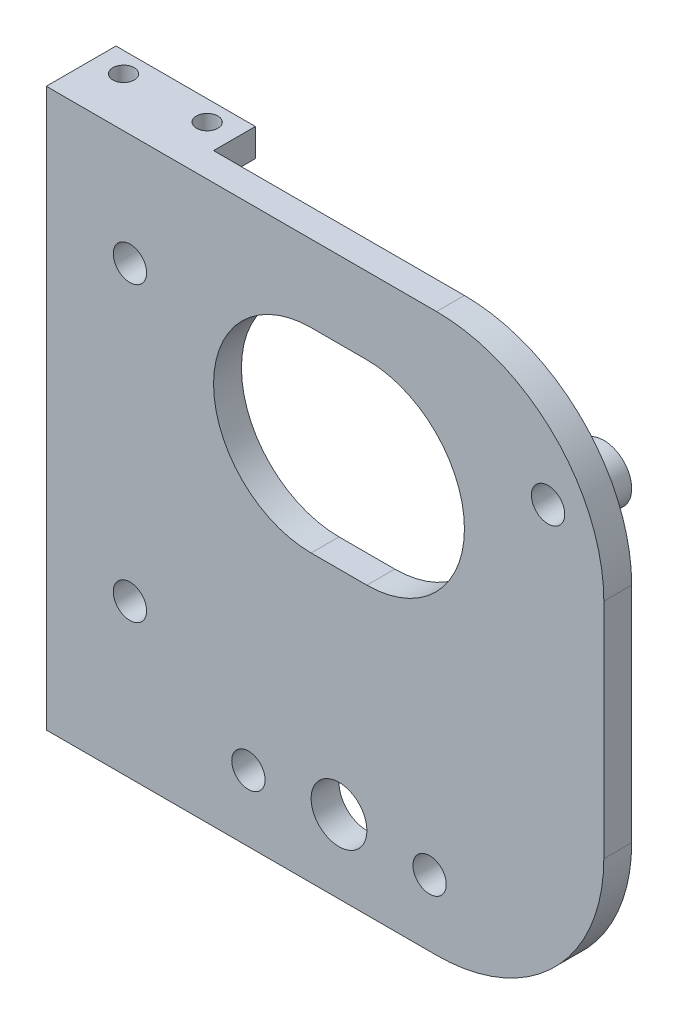
ISO-10303-21;
HEADER;
FILE_DESCRIPTION(('STEP AP214'),'2;1');
FILE_NAME('part.step','',(''),(''),'','','');
FILE_SCHEMA(('AUTOMOTIVE_DESIGN { 1 0 10303 214 1 1 1 1 }'));
ENDSEC;
DATA;
#1=APPLICATION_CONTEXT('core data for automotive mechanical design processes');
#2=APPLICATION_PROTOCOL_DEFINITION('international standard','automotive_design',2000,#1);
#3=PRODUCT_CONTEXT('',#1,'mechanical');
#4=PRODUCT('Part','Part','',(#3));
#5=PRODUCT_RELATED_PRODUCT_CATEGORY('part','',(#4));
#6=PRODUCT_DEFINITION_FORMATION('','',#4);
#7=PRODUCT_DEFINITION_CONTEXT('part definition',#1,'design');
#8=PRODUCT_DEFINITION('design','',#6,#7);
#9=PRODUCT_DEFINITION_SHAPE('','',#8);
#10=(LENGTH_UNIT() NAMED_UNIT(*) SI_UNIT(.MILLI.,.METRE.));
#11=(NAMED_UNIT(*) PLANE_ANGLE_UNIT() SI_UNIT($,.RADIAN.));
#12=(NAMED_UNIT(*) SI_UNIT($,.STERADIAN.) SOLID_ANGLE_UNIT());
#13=UNCERTAINTY_MEASURE_WITH_UNIT(LENGTH_MEASURE(1.E-05),#10,'distance_accuracy_value','');
#14=(GEOMETRIC_REPRESENTATION_CONTEXT(3) GLOBAL_UNCERTAINTY_ASSIGNED_CONTEXT((#13)) GLOBAL_UNIT_ASSIGNED_CONTEXT((#10,
#11,#12)) REPRESENTATION_CONTEXT('',''));
#15=CARTESIAN_POINT('',(0.,0.,0.));
#16=DIRECTION('',(0.,0.,1.));
#17=DIRECTION('',(1.,0.,0.));
#18=AXIS2_PLACEMENT_3D('',#15,#16,#17);
#19=CARTESIAN_POINT('',(0.,0.,0.));
#20=DIRECTION('',(0.,0.,1.));
#21=DIRECTION('',(1.,0.,0.));
#22=AXIS2_PLACEMENT_3D('',#19,#20,#21);
#23=PLANE('',#22);
#24=DIRECTION('',(-1.,0.,0.));
#25=VECTOR('',#24,1.);
#26=CARTESIAN_POINT('',(-1.5874999999998,23.01875,0.));
#27=LINE('',#26,#25);
#28=CARTESIAN_POINT('',(4.7625000000002,23.01875,0.));
#29=VERTEX_POINT('',#28);
#30=CARTESIAN_POINT('',(-1.5874999999998,23.01875,0.));
#31=VERTEX_POINT('',#30);
#32=EDGE_CURVE('E154',#29,#31,#27,.T.);
#33=ORIENTED_EDGE('',*,*,#32,.T.);
#34=CARTESIAN_POINT('',(-1.5874999999998,11.90625,0.));
#35=DIRECTION('',(0.,0.,1.));
#36=DIRECTION('',(1.,0.,0.));
#37=AXIS2_PLACEMENT_3D('',#34,#35,#36);
#38=CIRCLE('',#37,11.1125);
#39=CARTESIAN_POINT('',(-1.5874999999998,0.793750000000013,0.));
#40=VERTEX_POINT('',#39);
#41=EDGE_CURVE('E148',#31,#40,#38,.T.);
#42=ORIENTED_EDGE('',*,*,#41,.T.);
#43=DIRECTION('',(1.,0.,0.));
#44=VECTOR('',#43,1.);
#45=CARTESIAN_POINT('',(-1.5874999999998,0.793750000000013,0.));
#46=LINE('',#45,#44);
#47=CARTESIAN_POINT('',(4.7625000000002,0.793750000000013,0.));
#48=VERTEX_POINT('',#47);
#49=EDGE_CURVE('E157',#40,#48,#46,.T.);
#50=ORIENTED_EDGE('',*,*,#49,.T.);
#51=CARTESIAN_POINT('',(4.7625000000002,11.90625,0.));
#52=DIRECTION('',(0.,0.,1.));
#53=DIRECTION('',(1.,0.,0.));
#54=AXIS2_PLACEMENT_3D('',#51,#52,#53);
#55=CIRCLE('',#54,11.1125);
#56=EDGE_CURVE('E49',#48,#29,#55,.T.);
#57=ORIENTED_EDGE('',*,*,#56,.T.);
#58=EDGE_LOOP('',(#33,#42,#50,#57));
#59=FACE_BOUND('',#58,.T.);
#60=CARTESIAN_POINT('',(1.58750000000017,-23.4156249999995,0.));
#61=DIRECTION('',(0.,0.,1.));
#62=DIRECTION('',(1.,0.,0.));
#63=AXIS2_PLACEMENT_3D('',#60,#61,#62);
#64=CIRCLE('',#63,3.175);
#65=CARTESIAN_POINT('',(4.76250000000017,-23.4156249999995,0.));
#66=VERTEX_POINT('',#65);
#67=EDGE_CURVE('E173',#66,#66,#64,.T.);
#68=ORIENTED_EDGE('',*,*,#67,.T.);
#69=EDGE_LOOP('',(#68));
#70=FACE_BOUND('',#69,.T.);
#71=CARTESIAN_POINT('',(11.9062499999999,-24.2093749999996,0.));
#72=DIRECTION('',(0.,0.,1.));
#73=DIRECTION('',(1.,0.,0.));
#74=AXIS2_PLACEMENT_3D('',#71,#72,#73);
#75=CIRCLE('',#74,3.175);
#76=CARTESIAN_POINT('',(15.0812499999999,-24.2093749999996,0.));
#77=VERTEX_POINT('',#76);
#78=EDGE_CURVE('E217',#77,#77,#75,.T.);
#79=ORIENTED_EDGE('',*,*,#78,.T.);
#80=EDGE_LOOP('',(#79));
#81=FACE_BOUND('',#80,.T.);
#82=CARTESIAN_POINT('',(-8.73125000000007,-24.2093749999995,0.));
#83=DIRECTION('',(0.,0.,1.));
#84=DIRECTION('',(1.,0.,0.));
#85=AXIS2_PLACEMENT_3D('',#82,#83,#84);
#86=CIRCLE('',#85,3.175);
#87=CARTESIAN_POINT('',(-5.55625000000007,-24.2093749999995,0.));
#88=VERTEX_POINT('',#87);
#89=EDGE_CURVE('E221',#88,#88,#86,.T.);
#90=ORIENTED_EDGE('',*,*,#89,.T.);
#91=EDGE_LOOP('',(#90));
#92=FACE_BOUND('',#91,.T.);
#93=CARTESIAN_POINT('',(-22.225,-14.2874999999994,0.));
#94=DIRECTION('',(0.,0.,1.));
#95=DIRECTION('',(1.,0.,0.));
#96=AXIS2_PLACEMENT_3D('',#93,#94,#95);
#97=CIRCLE('',#96,3.175);
#98=CARTESIAN_POINT('',(-19.05,-14.2874999999994,0.));
#99=VERTEX_POINT('',#98);
#100=EDGE_CURVE('E227',#99,#99,#97,.T.);
#101=ORIENTED_EDGE('',*,*,#100,.T.);
#102=EDGE_LOOP('',(#101));
#103=FACE_BOUND('',#102,.T.);
#104=CARTESIAN_POINT('',(-22.2249999999998,19.0500000000006,0.));
#105=DIRECTION('',(0.,0.,1.));
#106=DIRECTION('',(1.,0.,0.));
#107=AXIS2_PLACEMENT_3D('',#104,#105,#106);
#108=CIRCLE('',#107,3.175);
#109=CARTESIAN_POINT('',(-19.0499999999998,19.0500000000006,0.));
#110=VERTEX_POINT('',#109);
#111=EDGE_CURVE('E233',#110,#110,#108,.T.);
#112=ORIENTED_EDGE('',*,*,#111,.T.);
#113=EDGE_LOOP('',(#112));
#114=FACE_BOUND('',#113,.T.);
#115=CARTESIAN_POINT('',(25.4000000000002,19.0500000000003,0.));
#116=DIRECTION('',(0.,0.,1.));
#117=DIRECTION('',(1.,0.,0.));
#118=AXIS2_PLACEMENT_3D('',#115,#116,#117);
#119=CIRCLE('',#118,3.175);
#120=CARTESIAN_POINT('',(28.5750000000002,19.0500000000003,0.));
#121=VERTEX_POINT('',#120);
#122=EDGE_CURVE('E239',#121,#121,#119,.T.);
#123=ORIENTED_EDGE('',*,*,#122,.T.);
#124=EDGE_LOOP('',(#123));
#125=FACE_BOUND('',#124,.T.);
#126=DIRECTION('',(0.,-1.,0.));
#127=VECTOR('',#126,1.);
#128=CARTESIAN_POINT('',(-15.875,31.75,0.));
#129=LINE('',#128,#127);
#130=CARTESIAN_POINT('',(-15.875,31.75,0.));
#131=VERTEX_POINT('',#130);
#132=CARTESIAN_POINT('',(-15.875,28.575,0.));
#133=VERTEX_POINT('',#132);
#134=EDGE_CURVE('E259',#131,#133,#129,.T.);
#135=ORIENTED_EDGE('',*,*,#134,.F.);
#136=DIRECTION('',(-1.,0.,0.));
#137=VECTOR('',#136,1.);
#138=CARTESIAN_POINT('',(-31.75,31.75,0.));
#139=LINE('',#138,#137);
#140=CARTESIAN_POINT('',(12.7,31.75,0.));
#141=VERTEX_POINT('',#140);
#142=EDGE_CURVE('E332',#141,#131,#139,.T.);
#143=ORIENTED_EDGE('',*,*,#142,.F.);
#144=CARTESIAN_POINT('',(12.7,12.7,0.));
#145=DIRECTION('',(0.,0.,1.));
#146=DIRECTION('',(1.,0.,0.));
#147=AXIS2_PLACEMENT_3D('',#144,#145,#146);
#148=CIRCLE('',#147,19.05);
#149=CARTESIAN_POINT('',(31.75,12.7,0.));
#150=VERTEX_POINT('',#149);
#151=EDGE_CURVE('E347',#141,#150,#148,.F.);
#152=ORIENTED_EDGE('',*,*,#151,.T.);
#153=DIRECTION('',(0.,1.,0.));
#154=VECTOR('',#153,1.);
#155=CARTESIAN_POINT('',(31.75,31.75,0.));
#156=LINE('',#155,#154);
#157=CARTESIAN_POINT('',(31.75,-12.7,0.));
#158=VERTEX_POINT('',#157);
#159=EDGE_CURVE('E317',#158,#150,#156,.T.);
#160=ORIENTED_EDGE('',*,*,#159,.F.);
#161=CARTESIAN_POINT('',(12.7,-12.7,0.));
#162=DIRECTION('',(0.,0.,1.));
#163=DIRECTION('',(1.,0.,0.));
#164=AXIS2_PLACEMENT_3D('',#161,#162,#163);
#165=CIRCLE('',#164,19.05);
#166=CARTESIAN_POINT('',(12.7,-31.75,0.));
#167=VERTEX_POINT('',#166);
#168=EDGE_CURVE('E345',#158,#167,#165,.F.);
#169=ORIENTED_EDGE('',*,*,#168,.T.);
#170=DIRECTION('',(1.,0.,0.));
#171=VECTOR('',#170,1.);
#172=CARTESIAN_POINT('',(-31.75,-31.75,0.));
#173=LINE('',#172,#171);
#174=CARTESIAN_POINT('',(-15.875,-31.75,0.));
#175=VERTEX_POINT('',#174);
#176=EDGE_CURVE('E322',#175,#167,#173,.T.);
#177=ORIENTED_EDGE('',*,*,#176,.F.);
#178=DIRECTION('',(0.,-1.,0.));
#179=VECTOR('',#178,1.);
#180=CARTESIAN_POINT('',(-15.875,-31.75,0.));
#181=LINE('',#180,#179);
#182=CARTESIAN_POINT('',(-15.875,-28.5949934874452,0.));
#183=VERTEX_POINT('',#182);
#184=EDGE_CURVE('E292',#183,#175,#181,.T.);
#185=ORIENTED_EDGE('',*,*,#184,.F.);
#186=DIRECTION('',(1.,0.,0.));
#187=VECTOR('',#186,1.);
#188=CARTESIAN_POINT('',(-15.875,-28.5949934874452,0.));
#189=LINE('',#188,#187);
#190=CARTESIAN_POINT('',(-31.75,-28.5949934874452,0.));
#191=VERTEX_POINT('',#190);
#192=EDGE_CURVE('E297',#191,#183,#189,.T.);
#193=ORIENTED_EDGE('',*,*,#192,.F.);
#194=DIRECTION('',(0.,-1.,0.));
#195=VECTOR('',#194,1.);
#196=CARTESIAN_POINT('',(-31.75,31.75,0.));
#197=LINE('',#196,#195);
#198=CARTESIAN_POINT('',(-31.75,28.575,0.));
#199=VERTEX_POINT('',#198);
#200=EDGE_CURVE('E335',#199,#191,#197,.T.);
#201=ORIENTED_EDGE('',*,*,#200,.F.);
#202=DIRECTION('',(-1.,0.,0.));
#203=VECTOR('',#202,1.);
#204=CARTESIAN_POINT('',(-31.75,28.575,0.));
#205=LINE('',#204,#203);
#206=EDGE_CURVE('E264',#133,#199,#205,.T.);
#207=ORIENTED_EDGE('',*,*,#206,.F.);
#208=EDGE_LOOP('',(#135,#143,#152,#160,#169,#177,#185,#193,#201,#207));
#209=FACE_BOUND('',#208,.T.);
#210=ADVANCED_FACE('F34',(#59,#70,#81,#92,#103,#114,#125,#209),#23,.F.);
#211=CARTESIAN_POINT('',(31.75,31.75,3.175));
#212=DIRECTION('',(-1.,0.,0.));
#213=DIRECTION('',(0.,0.,1.));
#214=AXIS2_PLACEMENT_3D('',#211,#212,#213);
#215=PLANE('',#214);
#216=ORIENTED_EDGE('',*,*,#159,.T.);
#217=DIRECTION('',(0.,0.,-1.));
#218=VECTOR('',#217,1.);
#219=CARTESIAN_POINT('',(31.75,12.7,3.175));
#220=LINE('',#219,#218);
#221=CARTESIAN_POINT('',(31.75,12.7,3.175));
#222=VERTEX_POINT('',#221);
#223=EDGE_CURVE('E352',#150,#222,#220,.F.);
#224=ORIENTED_EDGE('',*,*,#223,.T.);
#225=DIRECTION('',(0.,1.,0.));
#226=VECTOR('',#225,1.);
#227=CARTESIAN_POINT('',(31.75,31.75,3.175));
#228=LINE('',#227,#226);
#229=CARTESIAN_POINT('',(31.75,-12.7,3.175));
#230=VERTEX_POINT('',#229);
#231=EDGE_CURVE('E318',#230,#222,#228,.T.);
#232=ORIENTED_EDGE('',*,*,#231,.F.);
#233=DIRECTION('',(0.,0.,-1.));
#234=VECTOR('',#233,1.);
#235=CARTESIAN_POINT('',(31.75,-12.7,3.175));
#236=LINE('',#235,#234);
#237=EDGE_CURVE('E349',#230,#158,#236,.T.);
#238=ORIENTED_EDGE('',*,*,#237,.T.);
#239=EDGE_LOOP('',(#216,#224,#232,#238));
#240=FACE_BOUND('',#239,.T.);
#241=ADVANCED_FACE('F374',(#240),#215,.F.);
#242=CARTESIAN_POINT('',(-31.75,31.75,3.175));
#243=DIRECTION('',(0.,-1.,0.));
#244=DIRECTION('',(0.,0.,-1.));
#245=AXIS2_PLACEMENT_3D('',#242,#243,#244);
#246=PLANE('',#245);
#247=CARTESIAN_POINT('',(-28.575,31.75,-2.44762947725263));
#248=DIRECTION('',(0.,1.,0.));
#249=DIRECTION('',(0.,0.,1.));
#250=AXIS2_PLACEMENT_3D('',#247,#248,#249);
#251=CIRCLE('',#250,1.21919999999999);
#252=CARTESIAN_POINT('',(-28.575,31.75,-1.22842947725265));
#253=VERTEX_POINT('',#252);
#254=EDGE_CURVE('E245',#253,#253,#251,.T.);
#255=ORIENTED_EDGE('',*,*,#254,.F.);
#256=EDGE_LOOP('',(#255));
#257=FACE_BOUND('',#256,.T.);
#258=CARTESIAN_POINT('',(-19.05,31.75,-2.44762947725263));
#259=DIRECTION('',(0.,1.,0.));
#260=DIRECTION('',(0.,0.,1.));
#261=AXIS2_PLACEMENT_3D('',#258,#259,#260);
#262=CIRCLE('',#261,1.21919999999999);
#263=CARTESIAN_POINT('',(-19.05,31.75,-1.22842947725265));
#264=VERTEX_POINT('',#263);
#265=EDGE_CURVE('E253',#264,#264,#262,.T.);
#266=ORIENTED_EDGE('',*,*,#265,.F.);
#267=EDGE_LOOP('',(#266));
#268=FACE_BOUND('',#267,.T.);
#269=DIRECTION('',(-1.,0.,0.));
#270=VECTOR('',#269,1.);
#271=CARTESIAN_POINT('',(-31.75,31.75,3.175));
#272=LINE('',#271,#270);
#273=CARTESIAN_POINT('',(12.7,31.75,3.175));
#274=VERTEX_POINT('',#273);
#275=CARTESIAN_POINT('',(-31.75,31.75,3.175));
#276=VERTEX_POINT('',#275);
#277=EDGE_CURVE('E321',#274,#276,#272,.T.);
#278=ORIENTED_EDGE('',*,*,#277,.F.);
#279=DIRECTION('',(0.,0.,-1.));
#280=VECTOR('',#279,1.);
#281=CARTESIAN_POINT('',(12.7,31.75,3.175));
#282=LINE('',#281,#280);
#283=EDGE_CURVE('E342',#274,#141,#282,.T.);
#284=ORIENTED_EDGE('',*,*,#283,.T.);
#285=ORIENTED_EDGE('',*,*,#142,.T.);
#286=DIRECTION('',(0.,0.,1.));
#287=VECTOR('',#286,1.);
#288=CARTESIAN_POINT('',(-15.875,31.75,-4.7625));
#289=LINE('',#288,#287);
#290=CARTESIAN_POINT('',(-15.875,31.75,-4.7625));
#291=VERTEX_POINT('',#290);
#292=EDGE_CURVE('E278',#291,#131,#289,.T.);
#293=ORIENTED_EDGE('',*,*,#292,.F.);
#294=DIRECTION('',(1.,0.,0.));
#295=VECTOR('',#294,1.);
#296=CARTESIAN_POINT('',(-31.75,31.75,-4.7625));
#297=LINE('',#296,#295);
#298=CARTESIAN_POINT('',(-31.75,31.75,-4.7625));
#299=VERTEX_POINT('',#298);
#300=EDGE_CURVE('E263',#299,#291,#297,.T.);
#301=ORIENTED_EDGE('',*,*,#300,.F.);
#302=DIRECTION('',(0.,0.,-1.));
#303=VECTOR('',#302,1.);
#304=CARTESIAN_POINT('',(-31.75,31.75,3.175));
#305=LINE('',#304,#303);
#306=EDGE_CURVE('E340',#276,#299,#305,.T.);
#307=ORIENTED_EDGE('',*,*,#306,.F.);
#308=EDGE_LOOP('',(#278,#284,#285,#293,#301,#307));
#309=FACE_BOUND('',#308,.T.);
#310=ADVANCED_FACE('F365',(#257,#268,#309),#246,.F.);
#311=CARTESIAN_POINT('',(-31.75,31.75,3.175));
#312=DIRECTION('',(1.,0.,0.));
#313=DIRECTION('',(0.,0.,-1.));
#314=AXIS2_PLACEMENT_3D('',#311,#312,#313);
#315=PLANE('',#314);
#316=ORIENTED_EDGE('',*,*,#306,.T.);
#317=DIRECTION('',(0.,1.,0.));
#318=VECTOR('',#317,1.);
#319=CARTESIAN_POINT('',(-31.75,31.75,-4.7625));
#320=LINE('',#319,#318);
#321=CARTESIAN_POINT('',(-31.75,28.575,-4.7625));
#322=VERTEX_POINT('',#321);
#323=EDGE_CURVE('E260',#322,#299,#320,.T.);
#324=ORIENTED_EDGE('',*,*,#323,.F.);
#325=DIRECTION('',(0.,0.,1.));
#326=VECTOR('',#325,1.);
#327=CARTESIAN_POINT('',(-31.75,28.575,-4.7625));
#328=LINE('',#327,#326);
#329=EDGE_CURVE('E270',#322,#199,#328,.T.);
#330=ORIENTED_EDGE('',*,*,#329,.T.);
#331=ORIENTED_EDGE('',*,*,#200,.T.);
#332=DIRECTION('',(0.,0.,1.));
#333=VECTOR('',#332,1.);
#334=CARTESIAN_POINT('',(-31.75,-28.5949934874452,-4.7625));
#335=LINE('',#334,#333);
#336=CARTESIAN_POINT('',(-31.75,-28.5949934874452,-4.7625));
#337=VERTEX_POINT('',#336);
#338=EDGE_CURVE('E311',#337,#191,#335,.T.);
#339=ORIENTED_EDGE('',*,*,#338,.F.);
#340=DIRECTION('',(0.,1.,0.));
#341=VECTOR('',#340,1.);
#342=CARTESIAN_POINT('',(-31.75,-31.75,-4.7625));
#343=LINE('',#342,#341);
#344=CARTESIAN_POINT('',(-31.75,-31.75,-4.7625));
#345=VERTEX_POINT('',#344);
#346=EDGE_CURVE('E300',#345,#337,#343,.T.);
#347=ORIENTED_EDGE('',*,*,#346,.F.);
#348=DIRECTION('',(0.,0.,-1.));
#349=VECTOR('',#348,1.);
#350=CARTESIAN_POINT('',(-31.75,-31.75,3.175));
#351=LINE('',#350,#349);
#352=CARTESIAN_POINT('',(-31.75,-31.75,3.175));
#353=VERTEX_POINT('',#352);
#354=EDGE_CURVE('E329',#353,#345,#351,.T.);
#355=ORIENTED_EDGE('',*,*,#354,.F.);
#356=DIRECTION('',(0.,-1.,0.));
#357=VECTOR('',#356,1.);
#358=CARTESIAN_POINT('',(-31.75,31.75,3.175));
#359=LINE('',#358,#357);
#360=EDGE_CURVE('E324',#276,#353,#359,.T.);
#361=ORIENTED_EDGE('',*,*,#360,.F.);
#362=EDGE_LOOP('',(#316,#324,#330,#331,#339,#347,#355,#361));
#363=FACE_BOUND('',#362,.T.);
#364=ADVANCED_FACE('F395',(#363),#315,.F.);
#365=CARTESIAN_POINT('',(-31.75,-31.75,3.175));
#366=DIRECTION('',(0.,1.,0.));
#367=DIRECTION('',(0.,0.,1.));
#368=AXIS2_PLACEMENT_3D('',#365,#366,#367);
#369=PLANE('',#368);
#370=CARTESIAN_POINT('',(-28.575,-31.75,-2.44762947725263));
#371=DIRECTION('',(0.,1.,0.));
#372=DIRECTION('',(0.,0.,1.));
#373=AXIS2_PLACEMENT_3D('',#370,#371,#372);
#374=CIRCLE('',#373,1.21919999999999);
#375=CARTESIAN_POINT('',(-28.575,-31.75,-1.22842947725264));
#376=VERTEX_POINT('',#375);
#377=EDGE_CURVE('E283',#376,#376,#374,.T.);
#378=ORIENTED_EDGE('',*,*,#377,.T.);
#379=EDGE_LOOP('',(#378));
#380=FACE_BOUND('',#379,.T.);
#381=CARTESIAN_POINT('',(-19.05,-31.75,-2.44762947725263));
#382=DIRECTION('',(0.,1.,0.));
#383=DIRECTION('',(0.,0.,1.));
#384=AXIS2_PLACEMENT_3D('',#381,#382,#383);
#385=CIRCLE('',#384,1.21919999999999);
#386=CARTESIAN_POINT('',(-19.05,-31.75,-1.22842947725264));
#387=VERTEX_POINT('',#386);
#388=EDGE_CURVE('E289',#387,#387,#385,.T.);
#389=ORIENTED_EDGE('',*,*,#388,.T.);
#390=EDGE_LOOP('',(#389));
#391=FACE_BOUND('',#390,.T.);
#392=ORIENTED_EDGE('',*,*,#176,.T.);
#393=DIRECTION('',(0.,0.,-1.));
#394=VECTOR('',#393,1.);
#395=CARTESIAN_POINT('',(12.7,-31.75,3.175));
#396=LINE('',#395,#394);
#397=CARTESIAN_POINT('',(12.7,-31.75,3.175));
#398=VERTEX_POINT('',#397);
#399=EDGE_CURVE('E11',#167,#398,#396,.F.);
#400=ORIENTED_EDGE('',*,*,#399,.T.);
#401=DIRECTION('',(1.,0.,0.));
#402=VECTOR('',#401,1.);
#403=CARTESIAN_POINT('',(-31.75,-31.75,3.175));
#404=LINE('',#403,#402);
#405=EDGE_CURVE('E326',#353,#398,#404,.T.);
#406=ORIENTED_EDGE('',*,*,#405,.F.);
#407=ORIENTED_EDGE('',*,*,#354,.T.);
#408=DIRECTION('',(-1.,0.,0.));
#409=VECTOR('',#408,1.);
#410=CARTESIAN_POINT('',(-15.875,-31.75,-4.7625));
#411=LINE('',#410,#409);
#412=CARTESIAN_POINT('',(-15.875,-31.75,-4.7625));
#413=VERTEX_POINT('',#412);
#414=EDGE_CURVE('E296',#413,#345,#411,.T.);
#415=ORIENTED_EDGE('',*,*,#414,.F.);
#416=DIRECTION('',(0.,0.,1.));
#417=VECTOR('',#416,1.);
#418=CARTESIAN_POINT('',(-15.875,-31.75,-4.7625));
#419=LINE('',#418,#417);
#420=EDGE_CURVE('E314',#413,#175,#419,.T.);
#421=ORIENTED_EDGE('',*,*,#420,.T.);
#422=EDGE_LOOP('',(#392,#400,#406,#407,#415,#421));
#423=FACE_BOUND('',#422,.T.);
#424=ADVANCED_FACE('F380',(#380,#391,#423),#369,.F.);
#425=CARTESIAN_POINT('',(0.,0.,3.175));
#426=DIRECTION('',(0.,0.,1.));
#427=DIRECTION('',(1.,0.,0.));
#428=AXIS2_PLACEMENT_3D('',#425,#426,#427);
#429=PLANE('',#428);
#430=CARTESIAN_POINT('',(-1.5874999999998,11.90625,3.175));
#431=DIRECTION('',(0.,0.,1.));
#432=DIRECTION('',(1.,0.,0.));
#433=AXIS2_PLACEMENT_3D('',#430,#431,#432);
#434=CIRCLE('',#433,11.1125);
#435=CARTESIAN_POINT('',(-1.5874999999998,23.01875,3.175));
#436=VERTEX_POINT('',#435);
#437=CARTESIAN_POINT('',(-1.5874999999998,0.793750000000013,3.175));
#438=VERTEX_POINT('',#437);
#439=EDGE_CURVE('E57',#436,#438,#434,.T.);
#440=ORIENTED_EDGE('',*,*,#439,.F.);
#441=DIRECTION('',(-1.,0.,0.));
#442=VECTOR('',#441,1.);
#443=CARTESIAN_POINT('',(-1.5874999999998,23.01875,3.175));
#444=LINE('',#443,#442);
#445=CARTESIAN_POINT('',(4.7625000000002,23.01875,3.175));
#446=VERTEX_POINT('',#445);
#447=EDGE_CURVE('E163',#446,#436,#444,.T.);
#448=ORIENTED_EDGE('',*,*,#447,.F.);
#449=CARTESIAN_POINT('',(4.7625000000002,11.90625,3.175));
#450=DIRECTION('',(0.,0.,1.));
#451=DIRECTION('',(1.,0.,0.));
#452=AXIS2_PLACEMENT_3D('',#449,#450,#451);
#453=CIRCLE('',#452,11.1125);
#454=CARTESIAN_POINT('',(4.7625000000002,0.793750000000013,3.175));
#455=VERTEX_POINT('',#454);
#456=EDGE_CURVE('E166',#455,#446,#453,.T.);
#457=ORIENTED_EDGE('',*,*,#456,.F.);
#458=DIRECTION('',(1.,0.,0.));
#459=VECTOR('',#458,1.);
#460=CARTESIAN_POINT('',(-1.5874999999998,0.793750000000013,3.175));
#461=LINE('',#460,#459);
#462=EDGE_CURVE('E172',#438,#455,#461,.T.);
#463=ORIENTED_EDGE('',*,*,#462,.F.);
#464=EDGE_LOOP('',(#440,#448,#457,#463));
#465=FACE_BOUND('',#464,.T.);
#466=CARTESIAN_POINT('',(1.58750000000017,-23.4156249999995,3.175));
#467=DIRECTION('',(0.,0.,1.));
#468=DIRECTION('',(1.,0.,0.));
#469=AXIS2_PLACEMENT_3D('',#466,#467,#468);
#470=CIRCLE('',#469,3.175);
#471=CARTESIAN_POINT('',(4.76250000000017,-23.4156249999995,3.175));
#472=VERTEX_POINT('',#471);
#473=EDGE_CURVE('E185',#472,#472,#470,.T.);
#474=ORIENTED_EDGE('',*,*,#473,.F.);
#475=EDGE_LOOP('',(#474));
#476=FACE_BOUND('',#475,.T.);
#477=CARTESIAN_POINT('',(25.4000000000002,19.0500000000003,3.17499999999999));
#478=DIRECTION('',(0.,0.,-1.));
#479=DIRECTION('',(-1.,0.,0.));
#480=AXIS2_PLACEMENT_3D('',#477,#478,#479);
#481=CIRCLE('',#480,1.89864999999999);
#482=CARTESIAN_POINT('',(23.5013500000002,19.0500000000003,3.17499999999999));
#483=VERTEX_POINT('',#482);
#484=EDGE_CURVE('E190',#483,#483,#481,.T.);
#485=ORIENTED_EDGE('',*,*,#484,.T.);
#486=EDGE_LOOP('',(#485));
#487=FACE_BOUND('',#486,.T.);
#488=CARTESIAN_POINT('',(-22.2249999999998,19.0500000000006,3.17499999999999));
#489=DIRECTION('',(0.,0.,-1.));
#490=DIRECTION('',(-1.,0.,0.));
#491=AXIS2_PLACEMENT_3D('',#488,#489,#490);
#492=CIRCLE('',#491,1.89864999999999);
#493=CARTESIAN_POINT('',(-24.1236499999998,19.0500000000006,3.17499999999999));
#494=VERTEX_POINT('',#493);
#495=EDGE_CURVE('E196',#494,#494,#492,.T.);
#496=ORIENTED_EDGE('',*,*,#495,.T.);
#497=EDGE_LOOP('',(#496));
#498=FACE_BOUND('',#497,.T.);
#499=CARTESIAN_POINT('',(-22.225,-14.2874999999994,3.17499999999999));
#500=DIRECTION('',(0.,0.,-1.));
#501=DIRECTION('',(-1.,0.,0.));
#502=AXIS2_PLACEMENT_3D('',#499,#500,#501);
#503=CIRCLE('',#502,1.89864999999999);
#504=CARTESIAN_POINT('',(-24.12365,-14.2874999999994,3.17499999999999));
#505=VERTEX_POINT('',#504);
#506=EDGE_CURVE('E202',#505,#505,#503,.T.);
#507=ORIENTED_EDGE('',*,*,#506,.T.);
#508=EDGE_LOOP('',(#507));
#509=FACE_BOUND('',#508,.T.);
#510=CARTESIAN_POINT('',(-8.73125000000007,-24.2093749999995,3.17499999999999));
#511=DIRECTION('',(0.,0.,-1.));
#512=DIRECTION('',(-1.,0.,0.));
#513=AXIS2_PLACEMENT_3D('',#510,#511,#512);
#514=CIRCLE('',#513,1.89864999999999);
#515=CARTESIAN_POINT('',(-10.6299000000001,-24.2093749999995,3.17499999999999));
#516=VERTEX_POINT('',#515);
#517=EDGE_CURVE('E208',#516,#516,#514,.T.);
#518=ORIENTED_EDGE('',*,*,#517,.T.);
#519=EDGE_LOOP('',(#518));
#520=FACE_BOUND('',#519,.T.);
#521=CARTESIAN_POINT('',(11.9062499999999,-24.2093749999996,3.17499999999999));
#522=DIRECTION('',(0.,0.,-1.));
#523=DIRECTION('',(-1.,0.,0.));
#524=AXIS2_PLACEMENT_3D('',#521,#522,#523);
#525=CIRCLE('',#524,1.89864999999999);
#526=CARTESIAN_POINT('',(10.0075999999999,-24.2093749999996,3.17499999999999));
#527=VERTEX_POINT('',#526);
#528=EDGE_CURVE('E214',#527,#527,#525,.T.);
#529=ORIENTED_EDGE('',*,*,#528,.T.);
#530=EDGE_LOOP('',(#529));
#531=FACE_BOUND('',#530,.T.);
#532=ORIENTED_EDGE('',*,*,#231,.T.);
#533=CARTESIAN_POINT('',(12.7,12.7,3.175));
#534=DIRECTION('',(0.,0.,1.));
#535=DIRECTION('',(1.,0.,0.));
#536=AXIS2_PLACEMENT_3D('',#533,#534,#535);
#537=CIRCLE('',#536,19.05);
#538=EDGE_CURVE('E42',#222,#274,#537,.T.);
#539=ORIENTED_EDGE('',*,*,#538,.T.);
#540=ORIENTED_EDGE('',*,*,#277,.T.);
#541=ORIENTED_EDGE('',*,*,#360,.T.);
#542=ORIENTED_EDGE('',*,*,#405,.T.);
#543=CARTESIAN_POINT('',(12.7,-12.7,3.175));
#544=DIRECTION('',(0.,0.,1.));
#545=DIRECTION('',(1.,0.,0.));
#546=AXIS2_PLACEMENT_3D('',#543,#544,#545);
#547=CIRCLE('',#546,19.05);
#548=EDGE_CURVE('E354',#398,#230,#547,.T.);
#549=ORIENTED_EDGE('',*,*,#548,.T.);
#550=EDGE_LOOP('',(#532,#539,#540,#541,#542,#549));
#551=FACE_BOUND('',#550,.T.);
#552=ADVANCED_FACE('F358',(#465,#476,#487,#498,#509,#520,#531,#551),#429,.T.);
#553=CARTESIAN_POINT('',(-15.875,-31.75,-4.7625));
#554=DIRECTION('',(-1.,0.,0.));
#555=DIRECTION('',(0.,0.,1.));
#556=AXIS2_PLACEMENT_3D('',#553,#554,#555);
#557=PLANE('',#556);
#558=ORIENTED_EDGE('',*,*,#184,.T.);
#559=ORIENTED_EDGE('',*,*,#420,.F.);
#560=DIRECTION('',(0.,-1.,0.));
#561=VECTOR('',#560,1.);
#562=CARTESIAN_POINT('',(-15.875,-31.75,-4.7625));
#563=LINE('',#562,#561);
#564=CARTESIAN_POINT('',(-15.875,-28.5949934874452,-4.7625));
#565=VERTEX_POINT('',#564);
#566=EDGE_CURVE('E293',#565,#413,#563,.T.);
#567=ORIENTED_EDGE('',*,*,#566,.F.);
#568=DIRECTION('',(0.,0.,1.));
#569=VECTOR('',#568,1.);
#570=CARTESIAN_POINT('',(-15.875,-28.5949934874452,-4.7625));
#571=LINE('',#570,#569);
#572=EDGE_CURVE('E304',#565,#183,#571,.T.);
#573=ORIENTED_EDGE('',*,*,#572,.T.);
#574=EDGE_LOOP('',(#558,#559,#567,#573));
#575=FACE_BOUND('',#574,.T.);
#576=ADVANCED_FACE('F385',(#575),#557,.F.);
#577=CARTESIAN_POINT('',(-15.875,-28.5949934874452,-4.7625));
#578=DIRECTION('',(0.,-1.,0.));
#579=DIRECTION('',(0.,0.,-1.));
#580=AXIS2_PLACEMENT_3D('',#577,#578,#579);
#581=PLANE('',#580);
#582=CARTESIAN_POINT('',(-28.575,-28.5949934874452,-2.44762947725263));
#583=DIRECTION('',(0.,1.,0.));
#584=DIRECTION('',(0.,0.,1.));
#585=AXIS2_PLACEMENT_3D('',#582,#583,#584);
#586=CIRCLE('',#585,1.21919999999999);
#587=CARTESIAN_POINT('',(-28.575,-28.5949934874452,-1.22842947725265));
#588=VERTEX_POINT('',#587);
#589=EDGE_CURVE('E280',#588,#588,#586,.T.);
#590=ORIENTED_EDGE('',*,*,#589,.F.);
#591=EDGE_LOOP('',(#590));
#592=FACE_BOUND('',#591,.T.);
#593=CARTESIAN_POINT('',(-19.05,-28.5949934874452,-2.44762947725263));
#594=DIRECTION('',(0.,1.,0.));
#595=DIRECTION('',(0.,0.,1.));
#596=AXIS2_PLACEMENT_3D('',#593,#594,#595);
#597=CIRCLE('',#596,1.21919999999999);
#598=CARTESIAN_POINT('',(-19.05,-28.5949934874452,-1.22842947725265));
#599=VERTEX_POINT('',#598);
#600=EDGE_CURVE('E286',#599,#599,#597,.T.);
#601=ORIENTED_EDGE('',*,*,#600,.F.);
#602=EDGE_LOOP('',(#601));
#603=FACE_BOUND('',#602,.T.);
#604=ORIENTED_EDGE('',*,*,#192,.T.);
#605=ORIENTED_EDGE('',*,*,#572,.F.);
#606=DIRECTION('',(1.,0.,0.));
#607=VECTOR('',#606,1.);
#608=CARTESIAN_POINT('',(-31.75,-28.5949934874452,-4.7625));
#609=LINE('',#608,#607);
#610=EDGE_CURVE('E302',#337,#565,#609,.T.);
#611=ORIENTED_EDGE('',*,*,#610,.F.);
#612=ORIENTED_EDGE('',*,*,#338,.T.);
#613=EDGE_LOOP('',(#604,#605,#611,#612));
#614=FACE_BOUND('',#613,.T.);
#615=ADVANCED_FACE('F390',(#592,#603,#614),#581,.F.);
#616=CARTESIAN_POINT('',(0.,0.,-4.7625));
#617=DIRECTION('',(0.,0.,1.));
#618=DIRECTION('',(1.,0.,0.));
#619=AXIS2_PLACEMENT_3D('',#616,#617,#618);
#620=PLANE('',#619);
#621=ORIENTED_EDGE('',*,*,#566,.T.);
#622=ORIENTED_EDGE('',*,*,#414,.T.);
#623=ORIENTED_EDGE('',*,*,#346,.T.);
#624=ORIENTED_EDGE('',*,*,#610,.T.);
#625=EDGE_LOOP('',(#621,#622,#623,#624));
#626=FACE_BOUND('',#625,.T.);
#627=ADVANCED_FACE('F411',(#626),#620,.F.);
#628=CARTESIAN_POINT('',(-19.05,-28.5949934874452,-2.44762947725263));
#629=DIRECTION('',(0.,1.,0.));
#630=DIRECTION('',(0.,0.,1.));
#631=AXIS2_PLACEMENT_3D('',#628,#629,#630);
#632=CYLINDRICAL_SURFACE('',#631,1.21919999999999);
#633=ORIENTED_EDGE('',*,*,#388,.F.);
#634=EDGE_LOOP('',(#633));
#635=FACE_BOUND('',#634,.T.);
#636=ORIENTED_EDGE('',*,*,#600,.T.);
#637=EDGE_LOOP('',(#636));
#638=FACE_BOUND('',#637,.T.);
#639=ADVANCED_FACE('F413',(#635,#638),#632,.F.);
#640=CARTESIAN_POINT('',(-28.575,-28.5949934874452,-2.44762947725263));
#641=DIRECTION('',(0.,1.,0.));
#642=DIRECTION('',(0.,0.,1.));
#643=AXIS2_PLACEMENT_3D('',#640,#641,#642);
#644=CYLINDRICAL_SURFACE('',#643,1.21919999999999);
#645=ORIENTED_EDGE('',*,*,#377,.F.);
#646=EDGE_LOOP('',(#645));
#647=FACE_BOUND('',#646,.T.);
#648=ORIENTED_EDGE('',*,*,#589,.T.);
#649=EDGE_LOOP('',(#648));
#650=FACE_BOUND('',#649,.T.);
#651=ADVANCED_FACE('F419',(#647,#650),#644,.F.);
#652=CARTESIAN_POINT('',(12.7,12.7,3.175));
#653=DIRECTION('',(0.,0.,-1.));
#654=DIRECTION('',(-1.,0.,0.));
#655=AXIS2_PLACEMENT_3D('',#652,#653,#654);
#656=CYLINDRICAL_SURFACE('',#655,19.05);
#657=ORIENTED_EDGE('',*,*,#538,.F.);
#658=ORIENTED_EDGE('',*,*,#223,.F.);
#659=ORIENTED_EDGE('',*,*,#151,.F.);
#660=ORIENTED_EDGE('',*,*,#283,.F.);
#661=EDGE_LOOP('',(#657,#658,#659,#660));
#662=FACE_BOUND('',#661,.T.);
#663=ADVANCED_FACE('F369',(#662),#656,.T.);
#664=CARTESIAN_POINT('',(12.7,-12.7,3.175));
#665=DIRECTION('',(0.,0.,-1.));
#666=DIRECTION('',(-1.,0.,0.));
#667=AXIS2_PLACEMENT_3D('',#664,#665,#666);
#668=CYLINDRICAL_SURFACE('',#667,19.05);
#669=ORIENTED_EDGE('',*,*,#548,.F.);
#670=ORIENTED_EDGE('',*,*,#399,.F.);
#671=ORIENTED_EDGE('',*,*,#168,.F.);
#672=ORIENTED_EDGE('',*,*,#237,.F.);
#673=EDGE_LOOP('',(#669,#670,#671,#672));
#674=FACE_BOUND('',#673,.T.);
#675=ADVANCED_FACE('F36',(#674),#668,.T.);
#676=CARTESIAN_POINT('',(-15.875,31.75,-4.7625));
#677=DIRECTION('',(-1.,0.,0.));
#678=DIRECTION('',(0.,0.,1.));
#679=AXIS2_PLACEMENT_3D('',#676,#677,#678);
#680=PLANE('',#679);
#681=ORIENTED_EDGE('',*,*,#134,.T.);
#682=DIRECTION('',(0.,0.,1.));
#683=VECTOR('',#682,1.);
#684=CARTESIAN_POINT('',(-15.875,28.575,-4.7625));
#685=LINE('',#684,#683);
#686=CARTESIAN_POINT('',(-15.875,28.575,-4.7625));
#687=VERTEX_POINT('',#686);
#688=EDGE_CURVE('E275',#687,#133,#685,.T.);
#689=ORIENTED_EDGE('',*,*,#688,.F.);
#690=DIRECTION('',(0.,-1.,0.));
#691=VECTOR('',#690,1.);
#692=CARTESIAN_POINT('',(-15.875,31.75,-4.7625));
#693=LINE('',#692,#691);
#694=EDGE_CURVE('E266',#291,#687,#693,.T.);
#695=ORIENTED_EDGE('',*,*,#694,.F.);
#696=ORIENTED_EDGE('',*,*,#292,.T.);
#697=EDGE_LOOP('',(#681,#689,#695,#696));
#698=FACE_BOUND('',#697,.T.);
#699=ADVANCED_FACE('F406',(#698),#680,.F.);
#700=CARTESIAN_POINT('',(-31.75,28.575,-4.7625));
#701=DIRECTION('',(0.,1.,0.));
#702=DIRECTION('',(0.,0.,1.));
#703=AXIS2_PLACEMENT_3D('',#700,#701,#702);
#704=PLANE('',#703);
#705=CARTESIAN_POINT('',(-28.575,28.575,-2.44762947725263));
#706=DIRECTION('',(0.,1.,0.));
#707=DIRECTION('',(0.,0.,1.));
#708=AXIS2_PLACEMENT_3D('',#705,#706,#707);
#709=CIRCLE('',#708,1.21919999999999);
#710=CARTESIAN_POINT('',(-28.575,28.575,-1.22842947725264));
#711=VERTEX_POINT('',#710);
#712=EDGE_CURVE('E250',#711,#711,#709,.T.);
#713=ORIENTED_EDGE('',*,*,#712,.T.);
#714=EDGE_LOOP('',(#713));
#715=FACE_BOUND('',#714,.T.);
#716=CARTESIAN_POINT('',(-19.05,28.575,-2.44762947725263));
#717=DIRECTION('',(0.,1.,0.));
#718=DIRECTION('',(0.,0.,1.));
#719=AXIS2_PLACEMENT_3D('',#716,#717,#718);
#720=CIRCLE('',#719,1.21919999999999);
#721=CARTESIAN_POINT('',(-19.05,28.575,-1.22842947725264));
#722=VERTEX_POINT('',#721);
#723=EDGE_CURVE('E256',#722,#722,#720,.T.);
#724=ORIENTED_EDGE('',*,*,#723,.T.);
#725=EDGE_LOOP('',(#724));
#726=FACE_BOUND('',#725,.T.);
#727=ORIENTED_EDGE('',*,*,#206,.T.);
#728=ORIENTED_EDGE('',*,*,#329,.F.);
#729=DIRECTION('',(-1.,0.,0.));
#730=VECTOR('',#729,1.);
#731=CARTESIAN_POINT('',(-31.75,28.575,-4.7625));
#732=LINE('',#731,#730);
#733=EDGE_CURVE('E268',#687,#322,#732,.T.);
#734=ORIENTED_EDGE('',*,*,#733,.F.);
#735=ORIENTED_EDGE('',*,*,#688,.T.);
#736=EDGE_LOOP('',(#727,#728,#734,#735));
#737=FACE_BOUND('',#736,.T.);
#738=ADVANCED_FACE('F401',(#715,#726,#737),#704,.F.);
#739=CARTESIAN_POINT('',(0.,0.,-4.7625));
#740=DIRECTION('',(0.,0.,1.));
#741=DIRECTION('',(1.,0.,0.));
#742=AXIS2_PLACEMENT_3D('',#739,#740,#741);
#743=PLANE('',#742);
#744=ORIENTED_EDGE('',*,*,#323,.T.);
#745=ORIENTED_EDGE('',*,*,#300,.T.);
#746=ORIENTED_EDGE('',*,*,#694,.T.);
#747=ORIENTED_EDGE('',*,*,#733,.T.);
#748=EDGE_LOOP('',(#744,#745,#746,#747));
#749=FACE_BOUND('',#748,.T.);
#750=ADVANCED_FACE('F409',(#749),#743,.F.);
#751=CARTESIAN_POINT('',(-19.05,31.75,-2.44762947725263));
#752=DIRECTION('',(0.,1.,0.));
#753=DIRECTION('',(0.,0.,1.));
#754=AXIS2_PLACEMENT_3D('',#751,#752,#753);
#755=CYLINDRICAL_SURFACE('',#754,1.21919999999999);
#756=ORIENTED_EDGE('',*,*,#723,.F.);
#757=EDGE_LOOP('',(#756));
#758=FACE_BOUND('',#757,.T.);
#759=ORIENTED_EDGE('',*,*,#265,.T.);
#760=EDGE_LOOP('',(#759));
#761=FACE_BOUND('',#760,.T.);
#762=ADVANCED_FACE('F459',(#758,#761),#755,.F.);
#763=CARTESIAN_POINT('',(-28.575,31.75,-2.44762947725263));
#764=DIRECTION('',(0.,1.,0.));
#765=DIRECTION('',(0.,0.,1.));
#766=AXIS2_PLACEMENT_3D('',#763,#764,#765);
#767=CYLINDRICAL_SURFACE('',#766,1.21919999999999);
#768=ORIENTED_EDGE('',*,*,#712,.F.);
#769=EDGE_LOOP('',(#768));
#770=FACE_BOUND('',#769,.T.);
#771=ORIENTED_EDGE('',*,*,#254,.T.);
#772=EDGE_LOOP('',(#771));
#773=FACE_BOUND('',#772,.T.);
#774=ADVANCED_FACE('F462',(#770,#773),#767,.F.);
#775=CARTESIAN_POINT('',(25.4000000000002,19.0500000000003,-3.175));
#776=DIRECTION('',(0.,0.,1.));
#777=DIRECTION('',(1.,0.,0.));
#778=AXIS2_PLACEMENT_3D('',#775,#776,#777);
#779=CYLINDRICAL_SURFACE('',#778,3.175);
#780=CARTESIAN_POINT('',(25.4000000000002,19.0500000000003,-3.175));
#781=DIRECTION('',(0.,0.,1.));
#782=DIRECTION('',(1.,0.,0.));
#783=AXIS2_PLACEMENT_3D('',#780,#781,#782);
#784=CIRCLE('',#783,3.175);
#785=CARTESIAN_POINT('',(28.5750000000002,19.0500000000003,-3.175));
#786=VERTEX_POINT('',#785);
#787=EDGE_CURVE('E242',#786,#786,#784,.T.);
#788=ORIENTED_EDGE('',*,*,#787,.T.);
#789=EDGE_LOOP('',(#788));
#790=FACE_BOUND('',#789,.T.);
#791=ORIENTED_EDGE('',*,*,#122,.F.);
#792=EDGE_LOOP('',(#791));
#793=FACE_BOUND('',#792,.T.);
#794=ADVANCED_FACE('F466',(#790,#793),#779,.T.);
#795=CARTESIAN_POINT('',(25.4000000000002,19.0500000000003,-3.175));
#796=DIRECTION('',(0.,0.,1.));
#797=DIRECTION('',(1.,0.,0.));
#798=AXIS2_PLACEMENT_3D('',#795,#796,#797);
#799=PLANE('',#798);
#800=CARTESIAN_POINT('',(25.4000000000002,19.0500000000003,-3.175));
#801=DIRECTION('',(0.,0.,-1.));
#802=DIRECTION('',(-1.,0.,0.));
#803=AXIS2_PLACEMENT_3D('',#800,#801,#802);
#804=CIRCLE('',#803,1.89864999999999);
#805=CARTESIAN_POINT('',(23.5013500000002,19.0500000000003,-3.175));
#806=VERTEX_POINT('',#805);
#807=EDGE_CURVE('E179',#806,#806,#804,.T.);
#808=ORIENTED_EDGE('',*,*,#807,.F.);
#809=EDGE_LOOP('',(#808));
#810=FACE_BOUND('',#809,.T.);
#811=ORIENTED_EDGE('',*,*,#787,.F.);
#812=EDGE_LOOP('',(#811));
#813=FACE_BOUND('',#812,.T.);
#814=ADVANCED_FACE('F470',(#810,#813),#799,.F.);
#815=CARTESIAN_POINT('',(-22.2249999999998,19.0500000000006,-3.175));
#816=DIRECTION('',(0.,0.,1.));
#817=DIRECTION('',(1.,0.,0.));
#818=AXIS2_PLACEMENT_3D('',#815,#816,#817);
#819=CYLINDRICAL_SURFACE('',#818,3.175);
#820=CARTESIAN_POINT('',(-22.2249999999998,19.0500000000006,-3.175));
#821=DIRECTION('',(0.,0.,1.));
#822=DIRECTION('',(1.,0.,0.));
#823=AXIS2_PLACEMENT_3D('',#820,#821,#822);
#824=CIRCLE('',#823,3.175);
#825=CARTESIAN_POINT('',(-19.0499999999998,19.0500000000006,-3.175));
#826=VERTEX_POINT('',#825);
#827=EDGE_CURVE('E236',#826,#826,#824,.T.);
#828=ORIENTED_EDGE('',*,*,#827,.T.);
#829=EDGE_LOOP('',(#828));
#830=FACE_BOUND('',#829,.T.);
#831=ORIENTED_EDGE('',*,*,#111,.F.);
#832=EDGE_LOOP('',(#831));
#833=FACE_BOUND('',#832,.T.);
#834=ADVANCED_FACE('F474',(#830,#833),#819,.T.);
#835=CARTESIAN_POINT('',(-22.2249999999998,19.0500000000006,-3.175));
#836=DIRECTION('',(0.,0.,1.));
#837=DIRECTION('',(1.,0.,0.));
#838=AXIS2_PLACEMENT_3D('',#835,#836,#837);
#839=PLANE('',#838);
#840=CARTESIAN_POINT('',(-22.2249999999998,19.0500000000006,-3.175));
#841=DIRECTION('',(0.,0.,-1.));
#842=DIRECTION('',(-1.,0.,0.));
#843=AXIS2_PLACEMENT_3D('',#840,#841,#842);
#844=CIRCLE('',#843,1.89864999999999);
#845=CARTESIAN_POINT('',(-24.1236499999998,19.0500000000006,-3.175));
#846=VERTEX_POINT('',#845);
#847=EDGE_CURVE('E193',#846,#846,#844,.T.);
#848=ORIENTED_EDGE('',*,*,#847,.F.);
#849=EDGE_LOOP('',(#848));
#850=FACE_BOUND('',#849,.T.);
#851=ORIENTED_EDGE('',*,*,#827,.F.);
#852=EDGE_LOOP('',(#851));
#853=FACE_BOUND('',#852,.T.);
#854=ADVANCED_FACE('F478',(#850,#853),#839,.F.);
#855=CARTESIAN_POINT('',(-22.225,-14.2874999999994,-3.175));
#856=DIRECTION('',(0.,0.,1.));
#857=DIRECTION('',(1.,0.,0.));
#858=AXIS2_PLACEMENT_3D('',#855,#856,#857);
#859=CYLINDRICAL_SURFACE('',#858,3.175);
#860=CARTESIAN_POINT('',(-22.225,-14.2874999999994,-3.175));
#861=DIRECTION('',(0.,0.,1.));
#862=DIRECTION('',(1.,0.,0.));
#863=AXIS2_PLACEMENT_3D('',#860,#861,#862);
#864=CIRCLE('',#863,3.175);
#865=CARTESIAN_POINT('',(-19.05,-14.2874999999994,-3.175));
#866=VERTEX_POINT('',#865);
#867=EDGE_CURVE('E230',#866,#866,#864,.T.);
#868=ORIENTED_EDGE('',*,*,#867,.T.);
#869=EDGE_LOOP('',(#868));
#870=FACE_BOUND('',#869,.T.);
#871=ORIENTED_EDGE('',*,*,#100,.F.);
#872=EDGE_LOOP('',(#871));
#873=FACE_BOUND('',#872,.T.);
#874=ADVANCED_FACE('F482',(#870,#873),#859,.T.);
#875=CARTESIAN_POINT('',(-22.225,-14.2874999999994,-3.175));
#876=DIRECTION('',(0.,0.,1.));
#877=DIRECTION('',(1.,0.,0.));
#878=AXIS2_PLACEMENT_3D('',#875,#876,#877);
#879=PLANE('',#878);
#880=CARTESIAN_POINT('',(-22.225,-14.2874999999994,-3.175));
#881=DIRECTION('',(0.,0.,-1.));
#882=DIRECTION('',(-1.,0.,0.));
#883=AXIS2_PLACEMENT_3D('',#880,#881,#882);
#884=CIRCLE('',#883,1.89864999999999);
#885=CARTESIAN_POINT('',(-24.12365,-14.2874999999994,-3.175));
#886=VERTEX_POINT('',#885);
#887=EDGE_CURVE('E199',#886,#886,#884,.T.);
#888=ORIENTED_EDGE('',*,*,#887,.F.);
#889=EDGE_LOOP('',(#888));
#890=FACE_BOUND('',#889,.T.);
#891=ORIENTED_EDGE('',*,*,#867,.F.);
#892=EDGE_LOOP('',(#891));
#893=FACE_BOUND('',#892,.T.);
#894=ADVANCED_FACE('F486',(#890,#893),#879,.F.);
#895=CARTESIAN_POINT('',(-8.73125000000007,-24.2093749999995,-3.175));
#896=DIRECTION('',(0.,0.,1.));
#897=DIRECTION('',(1.,0.,0.));
#898=AXIS2_PLACEMENT_3D('',#895,#896,#897);
#899=CYLINDRICAL_SURFACE('',#898,3.175);
#900=CARTESIAN_POINT('',(-8.73125000000007,-24.2093749999995,-3.175));
#901=DIRECTION('',(0.,0.,1.));
#902=DIRECTION('',(1.,0.,0.));
#903=AXIS2_PLACEMENT_3D('',#900,#901,#902);
#904=CIRCLE('',#903,3.175);
#905=CARTESIAN_POINT('',(-5.55625000000007,-24.2093749999995,-3.175));
#906=VERTEX_POINT('',#905);
#907=EDGE_CURVE('E224',#906,#906,#904,.T.);
#908=ORIENTED_EDGE('',*,*,#907,.T.);
#909=EDGE_LOOP('',(#908));
#910=FACE_BOUND('',#909,.T.);
#911=ORIENTED_EDGE('',*,*,#89,.F.);
#912=EDGE_LOOP('',(#911));
#913=FACE_BOUND('',#912,.T.);
#914=ADVANCED_FACE('F490',(#910,#913),#899,.T.);
#915=CARTESIAN_POINT('',(-8.73125000000007,-24.2093749999995,-3.175));
#916=DIRECTION('',(0.,0.,1.));
#917=DIRECTION('',(1.,0.,0.));
#918=AXIS2_PLACEMENT_3D('',#915,#916,#917);
#919=PLANE('',#918);
#920=CARTESIAN_POINT('',(-8.73125000000007,-24.2093749999995,-3.175));
#921=DIRECTION('',(0.,0.,-1.));
#922=DIRECTION('',(-1.,0.,0.));
#923=AXIS2_PLACEMENT_3D('',#920,#921,#922);
#924=CIRCLE('',#923,1.89864999999999);
#925=CARTESIAN_POINT('',(-10.6299000000001,-24.2093749999995,-3.175));
#926=VERTEX_POINT('',#925);
#927=EDGE_CURVE('E205',#926,#926,#924,.T.);
#928=ORIENTED_EDGE('',*,*,#927,.F.);
#929=EDGE_LOOP('',(#928));
#930=FACE_BOUND('',#929,.T.);
#931=ORIENTED_EDGE('',*,*,#907,.F.);
#932=EDGE_LOOP('',(#931));
#933=FACE_BOUND('',#932,.T.);
#934=ADVANCED_FACE('F494',(#930,#933),#919,.F.);
#935=CARTESIAN_POINT('',(11.9062499999999,-24.2093749999996,-3.175));
#936=DIRECTION('',(0.,0.,1.));
#937=DIRECTION('',(1.,0.,0.));
#938=AXIS2_PLACEMENT_3D('',#935,#936,#937);
#939=CYLINDRICAL_SURFACE('',#938,3.175);
#940=CARTESIAN_POINT('',(11.9062499999999,-24.2093749999996,-3.175));
#941=DIRECTION('',(0.,0.,1.));
#942=DIRECTION('',(1.,0.,0.));
#943=AXIS2_PLACEMENT_3D('',#940,#941,#942);
#944=CIRCLE('',#943,3.175);
#945=CARTESIAN_POINT('',(15.0812499999999,-24.2093749999996,-3.175));
#946=VERTEX_POINT('',#945);
#947=EDGE_CURVE('E218',#946,#946,#944,.T.);
#948=ORIENTED_EDGE('',*,*,#947,.T.);
#949=EDGE_LOOP('',(#948));
#950=FACE_BOUND('',#949,.T.);
#951=ORIENTED_EDGE('',*,*,#78,.F.);
#952=EDGE_LOOP('',(#951));
#953=FACE_BOUND('',#952,.T.);
#954=ADVANCED_FACE('F498',(#950,#953),#939,.T.);
#955=CARTESIAN_POINT('',(11.9062499999999,-24.2093749999996,-3.175));
#956=DIRECTION('',(0.,0.,1.));
#957=DIRECTION('',(1.,0.,0.));
#958=AXIS2_PLACEMENT_3D('',#955,#956,#957);
#959=PLANE('',#958);
#960=CARTESIAN_POINT('',(11.9062499999999,-24.2093749999996,-3.175));
#961=DIRECTION('',(0.,0.,-1.));
#962=DIRECTION('',(-1.,0.,0.));
#963=AXIS2_PLACEMENT_3D('',#960,#961,#962);
#964=CIRCLE('',#963,1.89864999999999);
#965=CARTESIAN_POINT('',(10.0075999999999,-24.2093749999996,-3.175));
#966=VERTEX_POINT('',#965);
#967=EDGE_CURVE('E211',#966,#966,#964,.T.);
#968=ORIENTED_EDGE('',*,*,#967,.F.);
#969=EDGE_LOOP('',(#968));
#970=FACE_BOUND('',#969,.T.);
#971=ORIENTED_EDGE('',*,*,#947,.F.);
#972=EDGE_LOOP('',(#971));
#973=FACE_BOUND('',#972,.T.);
#974=ADVANCED_FACE('F502',(#970,#973),#959,.F.);
#975=CARTESIAN_POINT('',(11.9062499999999,-24.2093749999996,-3.175));
#976=DIRECTION('',(0.,0.,-1.));
#977=DIRECTION('',(-1.,0.,0.));
#978=AXIS2_PLACEMENT_3D('',#975,#976,#977);
#979=CYLINDRICAL_SURFACE('',#978,1.89864999999999);
#980=ORIENTED_EDGE('',*,*,#528,.F.);
#981=EDGE_LOOP('',(#980));
#982=FACE_BOUND('',#981,.T.);
#983=ORIENTED_EDGE('',*,*,#967,.T.);
#984=EDGE_LOOP('',(#983));
#985=FACE_BOUND('',#984,.T.);
#986=ADVANCED_FACE('F506',(#982,#985),#979,.F.);
#987=CARTESIAN_POINT('',(-8.73125000000007,-24.2093749999995,-3.175));
#988=DIRECTION('',(0.,0.,-1.));
#989=DIRECTION('',(-1.,0.,0.));
#990=AXIS2_PLACEMENT_3D('',#987,#988,#989);
#991=CYLINDRICAL_SURFACE('',#990,1.89864999999999);
#992=ORIENTED_EDGE('',*,*,#517,.F.);
#993=EDGE_LOOP('',(#992));
#994=FACE_BOUND('',#993,.T.);
#995=ORIENTED_EDGE('',*,*,#927,.T.);
#996=EDGE_LOOP('',(#995));
#997=FACE_BOUND('',#996,.T.);
#998=ADVANCED_FACE('F510',(#994,#997),#991,.F.);
#999=CARTESIAN_POINT('',(-22.225,-14.2874999999994,-3.175));
#1000=DIRECTION('',(0.,0.,-1.));
#1001=DIRECTION('',(-1.,0.,0.));
#1002=AXIS2_PLACEMENT_3D('',#999,#1000,#1001);
#1003=CYLINDRICAL_SURFACE('',#1002,1.89864999999999);
#1004=ORIENTED_EDGE('',*,*,#506,.F.);
#1005=EDGE_LOOP('',(#1004));
#1006=FACE_BOUND('',#1005,.T.);
#1007=ORIENTED_EDGE('',*,*,#887,.T.);
#1008=EDGE_LOOP('',(#1007));
#1009=FACE_BOUND('',#1008,.T.);
#1010=ADVANCED_FACE('F514',(#1006,#1009),#1003,.F.);
#1011=CARTESIAN_POINT('',(-22.2249999999998,19.0500000000006,-3.175));
#1012=DIRECTION('',(0.,0.,-1.));
#1013=DIRECTION('',(-1.,0.,0.));
#1014=AXIS2_PLACEMENT_3D('',#1011,#1012,#1013);
#1015=CYLINDRICAL_SURFACE('',#1014,1.89864999999999);
#1016=ORIENTED_EDGE('',*,*,#495,.F.);
#1017=EDGE_LOOP('',(#1016));
#1018=FACE_BOUND('',#1017,.T.);
#1019=ORIENTED_EDGE('',*,*,#847,.T.);
#1020=EDGE_LOOP('',(#1019));
#1021=FACE_BOUND('',#1020,.T.);
#1022=ADVANCED_FACE('F518',(#1018,#1021),#1015,.F.);
#1023=CARTESIAN_POINT('',(25.4000000000002,19.0500000000003,-3.175));
#1024=DIRECTION('',(0.,0.,-1.));
#1025=DIRECTION('',(-1.,0.,0.));
#1026=AXIS2_PLACEMENT_3D('',#1023,#1024,#1025);
#1027=CYLINDRICAL_SURFACE('',#1026,1.89864999999999);
#1028=ORIENTED_EDGE('',*,*,#484,.F.);
#1029=EDGE_LOOP('',(#1028));
#1030=FACE_BOUND('',#1029,.T.);
#1031=ORIENTED_EDGE('',*,*,#807,.T.);
#1032=EDGE_LOOP('',(#1031));
#1033=FACE_BOUND('',#1032,.T.);
#1034=ADVANCED_FACE('F522',(#1030,#1033),#1027,.F.);
#1035=CARTESIAN_POINT('',(1.58750000000017,-23.4156249999995,0.));
#1036=DIRECTION('',(0.,0.,1.));
#1037=DIRECTION('',(1.,0.,0.));
#1038=AXIS2_PLACEMENT_3D('',#1035,#1036,#1037);
#1039=CYLINDRICAL_SURFACE('',#1038,3.175);
#1040=ORIENTED_EDGE('',*,*,#67,.F.);
#1041=EDGE_LOOP('',(#1040));
#1042=FACE_BOUND('',#1041,.T.);
#1043=ORIENTED_EDGE('',*,*,#473,.T.);
#1044=EDGE_LOOP('',(#1043));
#1045=FACE_BOUND('',#1044,.T.);
#1046=ADVANCED_FACE('F526',(#1042,#1045),#1039,.F.);
#1047=CARTESIAN_POINT('',(-1.5874999999998,11.90625,0.));
#1048=DIRECTION('',(0.,0.,1.));
#1049=DIRECTION('',(1.,0.,0.));
#1050=AXIS2_PLACEMENT_3D('',#1047,#1048,#1049);
#1051=CYLINDRICAL_SURFACE('',#1050,11.1125);
#1052=ORIENTED_EDGE('',*,*,#439,.T.);
#1053=DIRECTION('',(0.,0.,1.));
#1054=VECTOR('',#1053,1.);
#1055=CARTESIAN_POINT('',(-1.5874999999998,0.793750000000013,0.));
#1056=LINE('',#1055,#1054);
#1057=EDGE_CURVE('E144',#40,#438,#1056,.T.);
#1058=ORIENTED_EDGE('',*,*,#1057,.F.);
#1059=ORIENTED_EDGE('',*,*,#41,.F.);
#1060=DIRECTION('',(0.,0.,1.));
#1061=VECTOR('',#1060,1.);
#1062=CARTESIAN_POINT('',(-1.5874999999998,23.01875,0.));
#1063=LINE('',#1062,#1061);
#1064=EDGE_CURVE('E177',#31,#436,#1063,.T.);
#1065=ORIENTED_EDGE('',*,*,#1064,.T.);
#1066=EDGE_LOOP('',(#1052,#1058,#1059,#1065));
#1067=FACE_BOUND('',#1066,.T.);
#1068=ADVANCED_FACE('F146',(#1067),#1051,.F.);
#1069=CARTESIAN_POINT('',(-1.5874999999998,23.01875,0.));
#1070=DIRECTION('',(0.,1.,0.));
#1071=DIRECTION('',(0.,0.,1.));
#1072=AXIS2_PLACEMENT_3D('',#1069,#1070,#1071);
#1073=PLANE('',#1072);
#1074=ORIENTED_EDGE('',*,*,#447,.T.);
#1075=ORIENTED_EDGE('',*,*,#1064,.F.);
#1076=ORIENTED_EDGE('',*,*,#32,.F.);
#1077=DIRECTION('',(0.,0.,1.));
#1078=VECTOR('',#1077,1.);
#1079=CARTESIAN_POINT('',(4.7625000000002,23.01875,0.));
#1080=LINE('',#1079,#1078);
#1081=EDGE_CURVE('E180',#29,#446,#1080,.T.);
#1082=ORIENTED_EDGE('',*,*,#1081,.T.);
#1083=EDGE_LOOP('',(#1074,#1075,#1076,#1082));
#1084=FACE_BOUND('',#1083,.T.);
#1085=ADVANCED_FACE('F533',(#1084),#1073,.F.);
#1086=CARTESIAN_POINT('',(4.7625000000002,11.90625,0.));
#1087=DIRECTION('',(0.,0.,1.));
#1088=DIRECTION('',(1.,0.,0.));
#1089=AXIS2_PLACEMENT_3D('',#1086,#1087,#1088);
#1090=CYLINDRICAL_SURFACE('',#1089,11.1125);
#1091=ORIENTED_EDGE('',*,*,#456,.T.);
#1092=ORIENTED_EDGE('',*,*,#1081,.F.);
#1093=ORIENTED_EDGE('',*,*,#56,.F.);
#1094=DIRECTION('',(0.,0.,1.));
#1095=VECTOR('',#1094,1.);
#1096=CARTESIAN_POINT('',(4.7625000000002,0.793750000000013,0.));
#1097=LINE('',#1096,#1095);
#1098=EDGE_CURVE('E153',#48,#455,#1097,.T.);
#1099=ORIENTED_EDGE('',*,*,#1098,.T.);
#1100=EDGE_LOOP('',(#1091,#1092,#1093,#1099));
#1101=FACE_BOUND('',#1100,.T.);
#1102=ADVANCED_FACE('F536',(#1101),#1090,.F.);
#1103=CARTESIAN_POINT('',(-1.5874999999998,0.793750000000013,0.));
#1104=DIRECTION('',(0.,-1.,0.));
#1105=DIRECTION('',(0.,0.,-1.));
#1106=AXIS2_PLACEMENT_3D('',#1103,#1104,#1105);
#1107=PLANE('',#1106);
#1108=ORIENTED_EDGE('',*,*,#462,.T.);
#1109=ORIENTED_EDGE('',*,*,#1098,.F.);
#1110=ORIENTED_EDGE('',*,*,#49,.F.);
#1111=ORIENTED_EDGE('',*,*,#1057,.T.);
#1112=EDGE_LOOP('',(#1108,#1109,#1110,#1111));
#1113=FACE_BOUND('',#1112,.T.);
#1114=ADVANCED_FACE('F158',(#1113),#1107,.F.);
#1115=CLOSED_SHELL('',(#210,#241,#310,#364,#424,#552,#576,#615,#627,#639,#651,#663,#675,#699,
#738,#750,#762,#774,#794,#814,#834,#854,#874,#894,#914,#934,#954,#974,#986,#998,#1010,#1022,
#1034,#1046,#1068,#1085,#1102,#1114));
#1116=MANIFOLD_SOLID_BREP('B2',#1115);
#1117=ADVANCED_BREP_SHAPE_REPRESENTATION('',(#18,#1116),#14);
#1118=SHAPE_DEFINITION_REPRESENTATION(#9,#1117);
ENDSEC;
END-ISO-10303-21;
